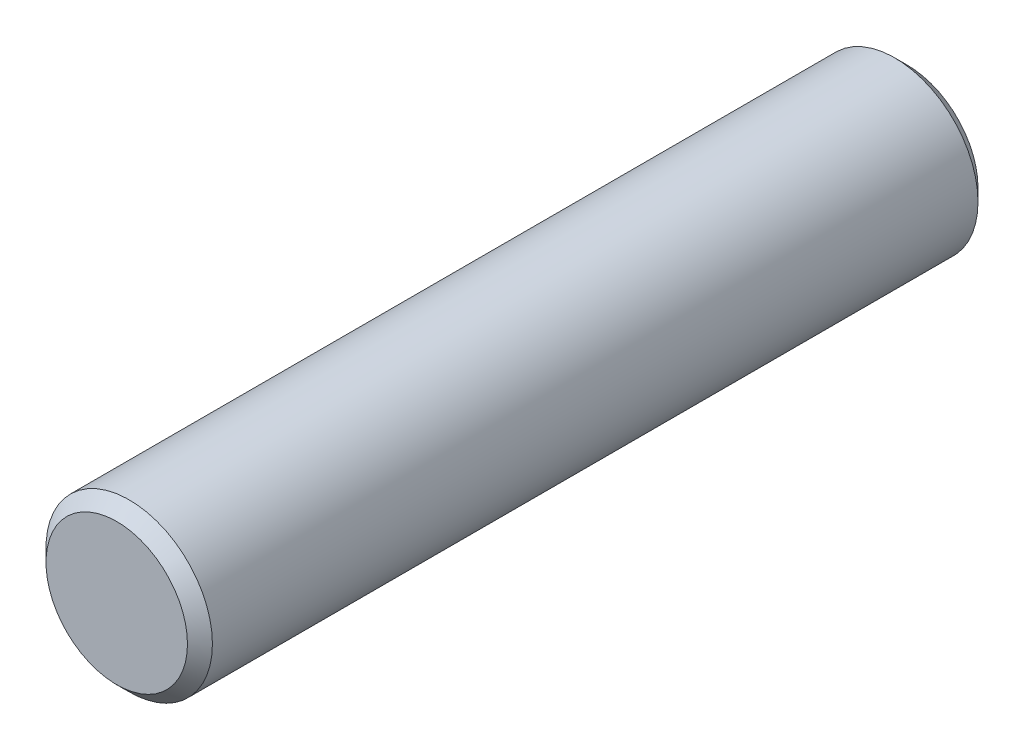
ISO-10303-21;
HEADER;
FILE_DESCRIPTION(('STEP AP214'),'2;1');
FILE_NAME('part.step','',(''),(''),'','','');
FILE_SCHEMA(('AUTOMOTIVE_DESIGN { 1 0 10303 214 1 1 1 1 }'));
ENDSEC;
DATA;
#1=APPLICATION_CONTEXT('core data for automotive mechanical design processes');
#2=APPLICATION_PROTOCOL_DEFINITION('international standard','automotive_design',2000,#1);
#3=PRODUCT_CONTEXT('',#1,'mechanical');
#4=PRODUCT('Part','Part','',(#3));
#5=PRODUCT_RELATED_PRODUCT_CATEGORY('part','',(#4));
#6=PRODUCT_DEFINITION_FORMATION('','',#4);
#7=PRODUCT_DEFINITION_CONTEXT('part definition',#1,'design');
#8=PRODUCT_DEFINITION('design','',#6,#7);
#9=PRODUCT_DEFINITION_SHAPE('','',#8);
#10=(LENGTH_UNIT() NAMED_UNIT(*) SI_UNIT(.MILLI.,.METRE.));
#11=(NAMED_UNIT(*) PLANE_ANGLE_UNIT() SI_UNIT($,.RADIAN.));
#12=(NAMED_UNIT(*) SI_UNIT($,.STERADIAN.) SOLID_ANGLE_UNIT());
#13=UNCERTAINTY_MEASURE_WITH_UNIT(LENGTH_MEASURE(1.E-05),#10,'distance_accuracy_value','');
#14=(GEOMETRIC_REPRESENTATION_CONTEXT(3) GLOBAL_UNCERTAINTY_ASSIGNED_CONTEXT((#13)) GLOBAL_UNIT_ASSIGNED_CONTEXT((#10,
#11,#12)) REPRESENTATION_CONTEXT('',''));
#15=CARTESIAN_POINT('',(0.,0.,0.));
#16=DIRECTION('',(0.,0.,1.));
#17=DIRECTION('',(1.,0.,0.));
#18=AXIS2_PLACEMENT_3D('',#15,#16,#17);
#19=CARTESIAN_POINT('',(0.,0.,38.));
#20=DIRECTION('',(0.,0.,-1.));
#21=DIRECTION('',(-1.,0.,0.));
#22=AXIS2_PLACEMENT_3D('',#19,#20,#21);
#23=CYLINDRICAL_SURFACE('',#22,4.);
#24=CARTESIAN_POINT('',(0.,0.,0.599999999999996));
#25=DIRECTION('',(0.,0.,1.));
#26=DIRECTION('',(1.,0.,0.));
#27=AXIS2_PLACEMENT_3D('',#24,#25,#26);
#28=CIRCLE('',#27,4.);
#29=CARTESIAN_POINT('',(4.,0.,0.599999999999996));
#30=VERTEX_POINT('',#29);
#31=EDGE_CURVE('E46',#30,#30,#28,.T.);
#32=ORIENTED_EDGE('',*,*,#31,.T.);
#33=EDGE_LOOP('',(#32));
#34=FACE_BOUND('',#33,.T.);
#35=CARTESIAN_POINT('',(0.,0.,37.4));
#36=DIRECTION('',(0.,0.,1.));
#37=DIRECTION('',(1.,0.,0.));
#38=AXIS2_PLACEMENT_3D('',#35,#36,#37);
#39=CIRCLE('',#38,4.);
#40=CARTESIAN_POINT('',(4.,0.,37.4));
#41=VERTEX_POINT('',#40);
#42=EDGE_CURVE('E50',#41,#41,#39,.F.);
#43=ORIENTED_EDGE('',*,*,#42,.T.);
#44=EDGE_LOOP('',(#43));
#45=FACE_BOUND('',#44,.T.);
#46=ADVANCED_FACE('F34',(#34,#45),#23,.T.);
#47=CARTESIAN_POINT('',(0.,0.,38.));
#48=DIRECTION('',(0.,0.,1.));
#49=DIRECTION('',(1.,0.,0.));
#50=AXIS2_PLACEMENT_3D('',#47,#48,#49);
#51=PLANE('',#50);
#52=CARTESIAN_POINT('',(0.,0.,38.));
#53=DIRECTION('',(0.,0.,1.));
#54=DIRECTION('',(1.,0.,0.));
#55=AXIS2_PLACEMENT_3D('',#52,#53,#54);
#56=CIRCLE('',#55,3.4);
#57=CARTESIAN_POINT('',(3.4,0.,38.));
#58=VERTEX_POINT('',#57);
#59=EDGE_CURVE('E10',#58,#58,#56,.T.);
#60=ORIENTED_EDGE('',*,*,#59,.T.);
#61=EDGE_LOOP('',(#60));
#62=FACE_BOUND('',#61,.T.);
#63=ADVANCED_FACE('F66',(#62),#51,.T.);
#64=CARTESIAN_POINT('',(0.,0.,0.));
#65=DIRECTION('',(0.,0.,1.));
#66=DIRECTION('',(1.,0.,0.));
#67=AXIS2_PLACEMENT_3D('',#64,#65,#66);
#68=PLANE('',#67);
#69=CARTESIAN_POINT('',(0.,0.,0.));
#70=DIRECTION('',(0.,0.,1.));
#71=DIRECTION('',(1.,0.,0.));
#72=AXIS2_PLACEMENT_3D('',#69,#70,#71);
#73=CIRCLE('',#72,3.4);
#74=CARTESIAN_POINT('',(3.4,0.,0.));
#75=VERTEX_POINT('',#74);
#76=EDGE_CURVE('E42',#75,#75,#73,.F.);
#77=ORIENTED_EDGE('',*,*,#76,.T.);
#78=EDGE_LOOP('',(#77));
#79=FACE_BOUND('',#78,.T.);
#80=ADVANCED_FACE('F63',(#79),#68,.F.);
#81=CARTESIAN_POINT('',(0.,0.,0.599999999999996));
#82=DIRECTION('',(0.,0.,1.));
#83=DIRECTION('',(1.,0.,0.));
#84=AXIS2_PLACEMENT_3D('',#81,#82,#83);
#85=CONICAL_SURFACE('',#84,4.,0.785398163397454);
#86=ORIENTED_EDGE('',*,*,#76,.F.);
#87=EDGE_LOOP('',(#86));
#88=FACE_BOUND('',#87,.T.);
#89=ORIENTED_EDGE('',*,*,#31,.F.);
#90=EDGE_LOOP('',(#89));
#91=FACE_BOUND('',#90,.T.);
#92=ADVANCED_FACE('F59',(#88,#91),#85,.T.);
#93=CARTESIAN_POINT('',(0.,0.,38.));
#94=DIRECTION('',(0.,0.,-1.));
#95=DIRECTION('',(-1.,0.,0.));
#96=AXIS2_PLACEMENT_3D('',#93,#94,#95);
#97=CONICAL_SURFACE('',#96,3.4,0.785398163397443);
#98=ORIENTED_EDGE('',*,*,#42,.F.);
#99=EDGE_LOOP('',(#98));
#100=FACE_BOUND('',#99,.T.);
#101=ORIENTED_EDGE('',*,*,#59,.F.);
#102=EDGE_LOOP('',(#101));
#103=FACE_BOUND('',#102,.T.);
#104=ADVANCED_FACE('F37',(#100,#103),#97,.T.);
#105=CLOSED_SHELL('',(#46,#63,#80,#92,#104));
#106=MANIFOLD_SOLID_BREP('B2',#105);
#107=ADVANCED_BREP_SHAPE_REPRESENTATION('',(#18,#106),#14);
#108=SHAPE_DEFINITION_REPRESENTATION(#9,#107);
ENDSEC;
END-ISO-10303-21;
